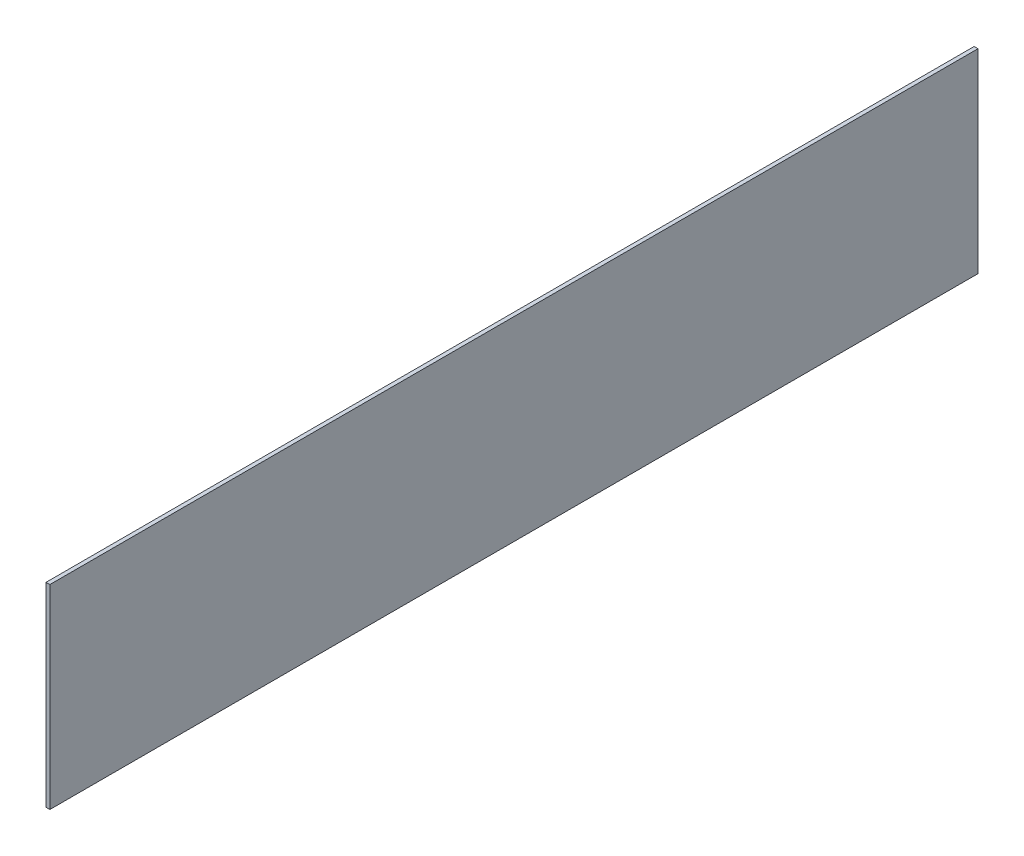
ISO-10303-21;
HEADER;
FILE_DESCRIPTION(('STEP AP214'),'2;1');
FILE_NAME('part.step','',(''),(''),'','','');
FILE_SCHEMA(('AUTOMOTIVE_DESIGN { 1 0 10303 214 1 1 1 1 }'));
ENDSEC;
DATA;
#1=APPLICATION_CONTEXT('core data for automotive mechanical design processes');
#2=APPLICATION_PROTOCOL_DEFINITION('international standard','automotive_design',2000,#1);
#3=PRODUCT_CONTEXT('',#1,'mechanical');
#4=PRODUCT('Part','Part','',(#3));
#5=PRODUCT_RELATED_PRODUCT_CATEGORY('part','',(#4));
#6=PRODUCT_DEFINITION_FORMATION('','',#4);
#7=PRODUCT_DEFINITION_CONTEXT('part definition',#1,'design');
#8=PRODUCT_DEFINITION('design','',#6,#7);
#9=PRODUCT_DEFINITION_SHAPE('','',#8);
#10=(LENGTH_UNIT() NAMED_UNIT(*) SI_UNIT(.MILLI.,.METRE.));
#11=(NAMED_UNIT(*) PLANE_ANGLE_UNIT() SI_UNIT($,.RADIAN.));
#12=(NAMED_UNIT(*) SI_UNIT($,.STERADIAN.) SOLID_ANGLE_UNIT());
#13=UNCERTAINTY_MEASURE_WITH_UNIT(LENGTH_MEASURE(1.E-05),#10,'distance_accuracy_value','');
#14=(GEOMETRIC_REPRESENTATION_CONTEXT(3) GLOBAL_UNCERTAINTY_ASSIGNED_CONTEXT((#13)) GLOBAL_UNIT_ASSIGNED_CONTEXT((#10,
#11,#12)) REPRESENTATION_CONTEXT('',''));
#15=CARTESIAN_POINT('',(0.,0.,0.));
#16=DIRECTION('',(0.,0.,1.));
#17=DIRECTION('',(1.,0.,0.));
#18=AXIS2_PLACEMENT_3D('',#15,#16,#17);
#19=CARTESIAN_POINT('',(0.62865,63.5,-302.480000068));
#20=DIRECTION('',(0.,0.,1.));
#21=DIRECTION('',(1.,0.,0.));
#22=AXIS2_PLACEMENT_3D('',#19,#20,#21);
#23=PLANE('',#22);
#24=DIRECTION('',(0.,1.,0.));
#25=VECTOR('',#24,1.);
#26=CARTESIAN_POINT('',(-0.62865,63.5,-302.480000068));
#27=LINE('',#26,#25);
#28=CARTESIAN_POINT('',(-0.62865,0.,-302.480000068));
#29=VERTEX_POINT('',#28);
#30=CARTESIAN_POINT('',(-0.62865,63.5,-302.480000068));
#31=VERTEX_POINT('',#30);
#32=EDGE_CURVE('E98',#29,#31,#27,.T.);
#33=ORIENTED_EDGE('',*,*,#32,.T.);
#34=DIRECTION('',(-1.,0.,0.));
#35=VECTOR('',#34,1.);
#36=CARTESIAN_POINT('',(0.62865,63.5,-302.480000068));
#37=LINE('',#36,#35);
#38=CARTESIAN_POINT('',(0.62865,63.5,-302.480000068));
#39=VERTEX_POINT('',#38);
#40=EDGE_CURVE('E11',#39,#31,#37,.T.);
#41=ORIENTED_EDGE('',*,*,#40,.F.);
#42=DIRECTION('',(0.,1.,0.));
#43=VECTOR('',#42,1.);
#44=CARTESIAN_POINT('',(0.62865,63.5,-302.480000068));
#45=LINE('',#44,#43);
#46=CARTESIAN_POINT('',(0.62865,0.,-302.480000068));
#47=VERTEX_POINT('',#46);
#48=EDGE_CURVE('E86',#47,#39,#45,.T.);
#49=ORIENTED_EDGE('',*,*,#48,.F.);
#50=DIRECTION('',(-1.,0.,0.));
#51=VECTOR('',#50,1.);
#52=CARTESIAN_POINT('',(0.62865,0.,-302.480000068));
#53=LINE('',#52,#51);
#54=EDGE_CURVE('E94',#47,#29,#53,.T.);
#55=ORIENTED_EDGE('',*,*,#54,.T.);
#56=EDGE_LOOP('',(#33,#41,#49,#55));
#57=FACE_BOUND('',#56,.T.);
#58=ADVANCED_FACE('F35',(#57),#23,.F.);
#59=CARTESIAN_POINT('',(0.62865,63.5,-302.480000068));
#60=DIRECTION('',(0.,-1.,0.));
#61=DIRECTION('',(0.,0.,-1.));
#62=AXIS2_PLACEMENT_3D('',#59,#60,#61);
#63=PLANE('',#62);
#64=DIRECTION('',(0.,0.,1.));
#65=VECTOR('',#64,1.);
#66=CARTESIAN_POINT('',(-0.62865,63.5,-302.480000068));
#67=LINE('',#66,#65);
#68=CARTESIAN_POINT('',(-0.62865,63.5,0.));
#69=VERTEX_POINT('',#68);
#70=EDGE_CURVE('E90',#31,#69,#67,.T.);
#71=ORIENTED_EDGE('',*,*,#70,.T.);
#72=DIRECTION('',(-1.,0.,0.));
#73=VECTOR('',#72,1.);
#74=CARTESIAN_POINT('',(0.62865,63.5,0.));
#75=LINE('',#74,#73);
#76=CARTESIAN_POINT('',(0.62865,63.5,0.));
#77=VERTEX_POINT('',#76);
#78=EDGE_CURVE('E43',#77,#69,#75,.T.);
#79=ORIENTED_EDGE('',*,*,#78,.F.);
#80=DIRECTION('',(0.,0.,1.));
#81=VECTOR('',#80,1.);
#82=CARTESIAN_POINT('',(0.62865,63.5,-302.480000068));
#83=LINE('',#82,#81);
#84=EDGE_CURVE('E81',#39,#77,#83,.T.);
#85=ORIENTED_EDGE('',*,*,#84,.F.);
#86=ORIENTED_EDGE('',*,*,#40,.T.);
#87=EDGE_LOOP('',(#71,#79,#85,#86));
#88=FACE_BOUND('',#87,.T.);
#89=ADVANCED_FACE('F89',(#88),#63,.F.);
#90=CARTESIAN_POINT('',(0.62865,63.5,0.));
#91=DIRECTION('',(0.,0.,-1.));
#92=DIRECTION('',(-1.,0.,0.));
#93=AXIS2_PLACEMENT_3D('',#90,#91,#92);
#94=PLANE('',#93);
#95=DIRECTION('',(0.,-1.,0.));
#96=VECTOR('',#95,1.);
#97=CARTESIAN_POINT('',(-0.62865,63.5,0.));
#98=LINE('',#97,#96);
#99=CARTESIAN_POINT('',(-0.62865,0.,0.));
#100=VERTEX_POINT('',#99);
#101=EDGE_CURVE('E68',#69,#100,#98,.T.);
#102=ORIENTED_EDGE('',*,*,#101,.T.);
#103=DIRECTION('',(-1.,0.,0.));
#104=VECTOR('',#103,1.);
#105=CARTESIAN_POINT('',(0.62865,0.,0.));
#106=LINE('',#105,#104);
#107=CARTESIAN_POINT('',(0.62865,0.,0.));
#108=VERTEX_POINT('',#107);
#109=EDGE_CURVE('E91',#108,#100,#106,.T.);
#110=ORIENTED_EDGE('',*,*,#109,.F.);
#111=DIRECTION('',(0.,-1.,0.));
#112=VECTOR('',#111,1.);
#113=CARTESIAN_POINT('',(0.62865,63.5,0.));
#114=LINE('',#113,#112);
#115=EDGE_CURVE('E84',#77,#108,#114,.T.);
#116=ORIENTED_EDGE('',*,*,#115,.F.);
#117=ORIENTED_EDGE('',*,*,#78,.T.);
#118=EDGE_LOOP('',(#102,#110,#116,#117));
#119=FACE_BOUND('',#118,.T.);
#120=ADVANCED_FACE('F92',(#119),#94,.F.);
#121=CARTESIAN_POINT('',(0.62865,0.,-302.480000068));
#122=DIRECTION('',(0.,1.,0.));
#123=DIRECTION('',(0.,0.,1.));
#124=AXIS2_PLACEMENT_3D('',#121,#122,#123);
#125=PLANE('',#124);
#126=DIRECTION('',(0.,0.,-1.));
#127=VECTOR('',#126,1.);
#128=CARTESIAN_POINT('',(-0.62865,0.,-302.480000068));
#129=LINE('',#128,#127);
#130=EDGE_CURVE('E74',#100,#29,#129,.T.);
#131=ORIENTED_EDGE('',*,*,#130,.T.);
#132=ORIENTED_EDGE('',*,*,#54,.F.);
#133=DIRECTION('',(0.,0.,-1.));
#134=VECTOR('',#133,1.);
#135=CARTESIAN_POINT('',(0.62865,0.,-302.480000068));
#136=LINE('',#135,#134);
#137=EDGE_CURVE('E51',#108,#47,#136,.T.);
#138=ORIENTED_EDGE('',*,*,#137,.F.);
#139=ORIENTED_EDGE('',*,*,#109,.T.);
#140=EDGE_LOOP('',(#131,#132,#138,#139));
#141=FACE_BOUND('',#140,.T.);
#142=ADVANCED_FACE('F105',(#141),#125,.F.);
#143=CARTESIAN_POINT('',(0.62865,0.,-302.480000068));
#144=DIRECTION('',(-1.,0.,0.));
#145=DIRECTION('',(0.,0.,1.));
#146=AXIS2_PLACEMENT_3D('',#143,#144,#145);
#147=PLANE('',#146);
#148=ORIENTED_EDGE('',*,*,#48,.T.);
#149=ORIENTED_EDGE('',*,*,#84,.T.);
#150=ORIENTED_EDGE('',*,*,#115,.T.);
#151=ORIENTED_EDGE('',*,*,#137,.T.);
#152=EDGE_LOOP('',(#148,#149,#150,#151));
#153=FACE_BOUND('',#152,.T.);
#154=ADVANCED_FACE('F82',(#153),#147,.F.);
#155=CARTESIAN_POINT('',(-0.62865,0.,-302.480000068));
#156=DIRECTION('',(-1.,0.,0.));
#157=DIRECTION('',(0.,0.,1.));
#158=AXIS2_PLACEMENT_3D('',#155,#156,#157);
#159=PLANE('',#158);
#160=ORIENTED_EDGE('',*,*,#32,.F.);
#161=ORIENTED_EDGE('',*,*,#130,.F.);
#162=ORIENTED_EDGE('',*,*,#101,.F.);
#163=ORIENTED_EDGE('',*,*,#70,.F.);
#164=EDGE_LOOP('',(#160,#161,#162,#163));
#165=FACE_BOUND('',#164,.T.);
#166=ADVANCED_FACE('F108',(#165),#159,.T.);
#167=CLOSED_SHELL('',(#58,#89,#120,#142,#154,#166));
#168=MANIFOLD_SOLID_BREP('B2',#167);
#169=ADVANCED_BREP_SHAPE_REPRESENTATION('',(#18,#168),#14);
#170=SHAPE_DEFINITION_REPRESENTATION(#9,#169);
ENDSEC;
END-ISO-10303-21;
